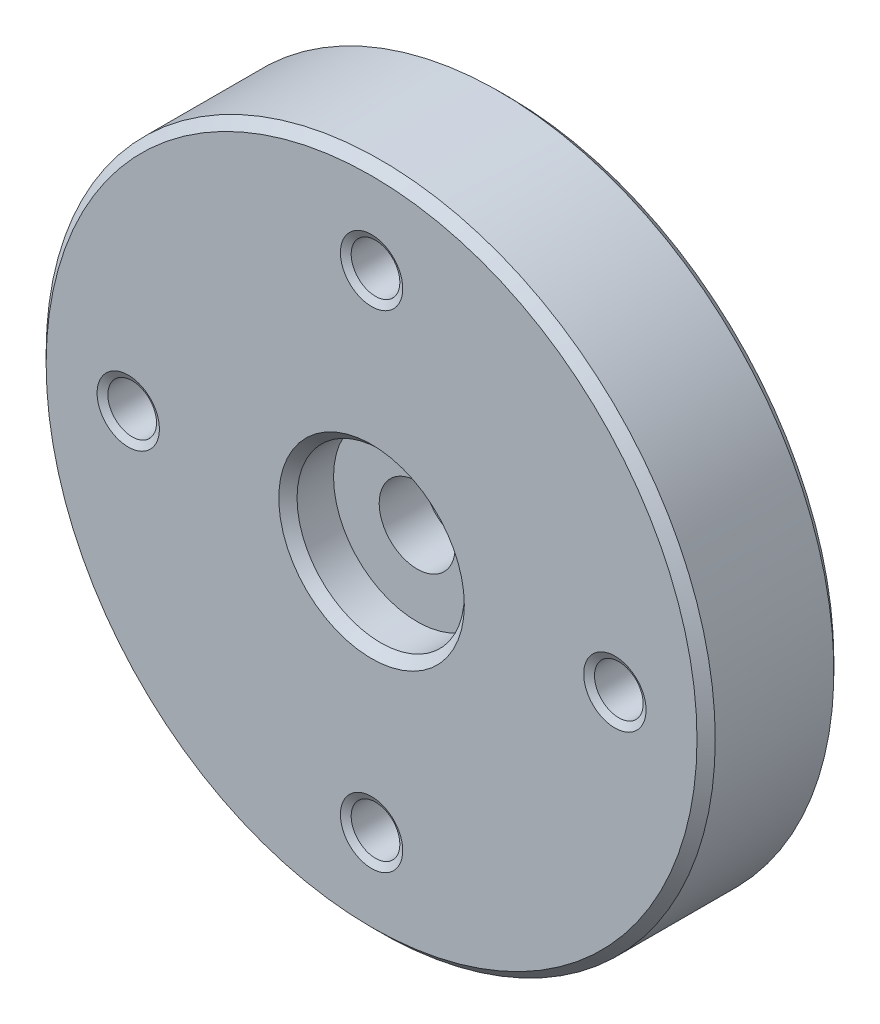
ISO-10303-21;
HEADER;
FILE_DESCRIPTION(('STEP AP214'),'2;1');
FILE_NAME('part.step','',(''),(''),'','','');
FILE_SCHEMA(('AUTOMOTIVE_DESIGN { 1 0 10303 214 1 1 1 1 }'));
ENDSEC;
DATA;
#1=APPLICATION_CONTEXT('core data for automotive mechanical design processes');
#2=APPLICATION_PROTOCOL_DEFINITION('international standard','automotive_design',2000,#1);
#3=PRODUCT_CONTEXT('',#1,'mechanical');
#4=PRODUCT('Part','Part','',(#3));
#5=PRODUCT_RELATED_PRODUCT_CATEGORY('part','',(#4));
#6=PRODUCT_DEFINITION_FORMATION('','',#4);
#7=PRODUCT_DEFINITION_CONTEXT('part definition',#1,'design');
#8=PRODUCT_DEFINITION('design','',#6,#7);
#9=PRODUCT_DEFINITION_SHAPE('','',#8);
#10=(LENGTH_UNIT() NAMED_UNIT(*) SI_UNIT(.MILLI.,.METRE.));
#11=(NAMED_UNIT(*) PLANE_ANGLE_UNIT() SI_UNIT($,.RADIAN.));
#12=(NAMED_UNIT(*) SI_UNIT($,.STERADIAN.) SOLID_ANGLE_UNIT());
#13=UNCERTAINTY_MEASURE_WITH_UNIT(LENGTH_MEASURE(1.E-05),#10,'distance_accuracy_value','');
#14=(GEOMETRIC_REPRESENTATION_CONTEXT(3) GLOBAL_UNCERTAINTY_ASSIGNED_CONTEXT((#13)) GLOBAL_UNIT_ASSIGNED_CONTEXT((#10,
#11,#12)) REPRESENTATION_CONTEXT('',''));
#15=CARTESIAN_POINT('',(0.,0.,0.));
#16=DIRECTION('',(0.,0.,1.));
#17=DIRECTION('',(1.,0.,0.));
#18=AXIS2_PLACEMENT_3D('',#15,#16,#17);
#19=CARTESIAN_POINT('',(0.,0.,0.));
#20=DIRECTION('',(0.,0.,-1.));
#21=DIRECTION('',(-1.,0.,0.));
#22=AXIS2_PLACEMENT_3D('',#19,#20,#21);
#23=CYLINDRICAL_SURFACE('',#22,2.75);
#24=CARTESIAN_POINT('',(0.,0.,-0.300000000000006));
#25=DIRECTION('',(0.,0.,1.));
#26=DIRECTION('',(1.,0.,0.));
#27=AXIS2_PLACEMENT_3D('',#24,#25,#26);
#28=CIRCLE('',#27,2.75);
#29=CARTESIAN_POINT('',(2.75,0.,-0.300000000000006));
#30=VERTEX_POINT('',#29);
#31=EDGE_CURVE('E55',#30,#30,#28,.T.);
#32=ORIENTED_EDGE('',*,*,#31,.T.);
#33=EDGE_LOOP('',(#32));
#34=FACE_BOUND('',#33,.T.);
#35=CARTESIAN_POINT('',(0.,0.,-1.5));
#36=DIRECTION('',(0.,0.,-1.));
#37=DIRECTION('',(-1.,0.,0.));
#38=AXIS2_PLACEMENT_3D('',#35,#36,#37);
#39=CIRCLE('',#38,2.75);
#40=CARTESIAN_POINT('',(-2.75,0.,-1.5));
#41=VERTEX_POINT('',#40);
#42=EDGE_CURVE('E79',#41,#41,#39,.T.);
#43=ORIENTED_EDGE('',*,*,#42,.T.);
#44=EDGE_LOOP('',(#43));
#45=FACE_BOUND('',#44,.T.);
#46=ADVANCED_FACE('F32',(#34,#45),#23,.F.);
#47=CARTESIAN_POINT('',(0.,2.75,0.));
#48=DIRECTION('',(0.,0.,1.));
#49=DIRECTION('',(1.,0.,0.));
#50=AXIS2_PLACEMENT_3D('',#47,#48,#49);
#51=PLANE('',#50);
#52=CARTESIAN_POINT('',(0.,0.,0.));
#53=DIRECTION('',(0.,0.,1.));
#54=DIRECTION('',(1.,0.,0.));
#55=AXIS2_PLACEMENT_3D('',#52,#53,#54);
#56=CIRCLE('',#55,3.05);
#57=CARTESIAN_POINT('',(3.05,0.,0.));
#58=VERTEX_POINT('',#57);
#59=EDGE_CURVE('E58',#58,#58,#56,.F.);
#60=ORIENTED_EDGE('',*,*,#59,.T.);
#61=EDGE_LOOP('',(#60));
#62=FACE_BOUND('',#61,.T.);
#63=CARTESIAN_POINT('',(0.,0.,0.));
#64=DIRECTION('',(0.,0.,1.));
#65=DIRECTION('',(1.,0.,0.));
#66=AXIS2_PLACEMENT_3D('',#63,#64,#65);
#67=CIRCLE('',#66,10.7);
#68=CARTESIAN_POINT('',(10.7,0.,0.));
#69=VERTEX_POINT('',#68);
#70=EDGE_CURVE('E61',#69,#69,#67,.T.);
#71=ORIENTED_EDGE('',*,*,#70,.T.);
#72=EDGE_LOOP('',(#71));
#73=FACE_BOUND('',#72,.T.);
#74=CARTESIAN_POINT('',(0.,8.,0.));
#75=DIRECTION('',(0.,0.,1.));
#76=DIRECTION('',(1.,0.,0.));
#77=AXIS2_PLACEMENT_3D('',#74,#75,#76);
#78=CIRCLE('',#77,1.025);
#79=CARTESIAN_POINT('',(1.025,8.,0.));
#80=VERTEX_POINT('',#79);
#81=EDGE_CURVE('E124',#80,#80,#78,.T.);
#82=ORIENTED_EDGE('',*,*,#81,.F.);
#83=EDGE_LOOP('',(#82));
#84=FACE_BOUND('',#83,.T.);
#85=CARTESIAN_POINT('',(8.,0.,0.));
#86=DIRECTION('',(0.,0.,1.));
#87=DIRECTION('',(1.,0.,0.));
#88=AXIS2_PLACEMENT_3D('',#85,#86,#87);
#89=CIRCLE('',#88,1.025);
#90=CARTESIAN_POINT('',(9.025,0.,0.));
#91=VERTEX_POINT('',#90);
#92=EDGE_CURVE('E112',#91,#91,#89,.T.);
#93=ORIENTED_EDGE('',*,*,#92,.F.);
#94=EDGE_LOOP('',(#93));
#95=FACE_BOUND('',#94,.T.);
#96=CARTESIAN_POINT('',(0.,-8.,0.));
#97=DIRECTION('',(0.,0.,1.));
#98=DIRECTION('',(1.,0.,0.));
#99=AXIS2_PLACEMENT_3D('',#96,#97,#98);
#100=CIRCLE('',#99,1.025);
#101=CARTESIAN_POINT('',(1.025,-8.,0.));
#102=VERTEX_POINT('',#101);
#103=EDGE_CURVE('E100',#102,#102,#100,.T.);
#104=ORIENTED_EDGE('',*,*,#103,.F.);
#105=EDGE_LOOP('',(#104));
#106=FACE_BOUND('',#105,.T.);
#107=CARTESIAN_POINT('',(-8.,0.,0.));
#108=DIRECTION('',(0.,0.,1.));
#109=DIRECTION('',(1.,0.,0.));
#110=AXIS2_PLACEMENT_3D('',#107,#108,#109);
#111=CIRCLE('',#110,1.025);
#112=CARTESIAN_POINT('',(-6.975,0.,0.));
#113=VERTEX_POINT('',#112);
#114=EDGE_CURVE('E88',#113,#113,#111,.T.);
#115=ORIENTED_EDGE('',*,*,#114,.F.);
#116=EDGE_LOOP('',(#115));
#117=FACE_BOUND('',#116,.T.);
#118=ADVANCED_FACE('F154',(#62,#73,#84,#95,#106,#117),#51,.T.);
#119=CARTESIAN_POINT('',(0.,0.,0.));
#120=DIRECTION('',(0.,0.,-1.));
#121=DIRECTION('',(-1.,0.,0.));
#122=AXIS2_PLACEMENT_3D('',#119,#120,#121);
#123=CYLINDRICAL_SURFACE('',#122,11.);
#124=CARTESIAN_POINT('',(0.,0.,-4.2));
#125=DIRECTION('',(0.,0.,-1.));
#126=DIRECTION('',(-1.,0.,0.));
#127=AXIS2_PLACEMENT_3D('',#124,#125,#126);
#128=CIRCLE('',#127,11.);
#129=CARTESIAN_POINT('',(-11.,0.,-4.2));
#130=VERTEX_POINT('',#129);
#131=EDGE_CURVE('E10',#130,#130,#128,.F.);
#132=ORIENTED_EDGE('',*,*,#131,.T.);
#133=EDGE_LOOP('',(#132));
#134=FACE_BOUND('',#133,.T.);
#135=CARTESIAN_POINT('',(0.,0.,-0.299999999999998));
#136=DIRECTION('',(0.,0.,1.));
#137=DIRECTION('',(1.,0.,0.));
#138=AXIS2_PLACEMENT_3D('',#135,#136,#137);
#139=CIRCLE('',#138,11.);
#140=CARTESIAN_POINT('',(11.,0.,-0.299999999999998));
#141=VERTEX_POINT('',#140);
#142=EDGE_CURVE('E39',#141,#141,#139,.F.);
#143=ORIENTED_EDGE('',*,*,#142,.T.);
#144=EDGE_LOOP('',(#143));
#145=FACE_BOUND('',#144,.T.);
#146=ADVANCED_FACE('F157',(#134,#145),#123,.T.);
#147=CARTESIAN_POINT('',(0.,11.,-4.5));
#148=DIRECTION('',(0.,0.,-1.));
#149=DIRECTION('',(-1.,0.,0.));
#150=AXIS2_PLACEMENT_3D('',#147,#148,#149);
#151=PLANE('',#150);
#152=CARTESIAN_POINT('',(0.,0.,-4.5));
#153=DIRECTION('',(0.,0.,-1.));
#154=DIRECTION('',(-1.,0.,0.));
#155=AXIS2_PLACEMENT_3D('',#152,#153,#154);
#156=CIRCLE('',#155,10.7);
#157=CARTESIAN_POINT('',(-10.7,0.,-4.5));
#158=VERTEX_POINT('',#157);
#159=EDGE_CURVE('E43',#158,#158,#156,.T.);
#160=ORIENTED_EDGE('',*,*,#159,.T.);
#161=EDGE_LOOP('',(#160));
#162=FACE_BOUND('',#161,.T.);
#163=CARTESIAN_POINT('',(0.,8.,-4.5));
#164=DIRECTION('',(0.,0.,1.));
#165=DIRECTION('',(1.,0.,0.));
#166=AXIS2_PLACEMENT_3D('',#163,#164,#165);
#167=CIRCLE('',#166,1.025);
#168=CARTESIAN_POINT('',(1.025,8.,-4.5));
#169=VERTEX_POINT('',#168);
#170=EDGE_CURVE('E127',#169,#169,#167,.T.);
#171=ORIENTED_EDGE('',*,*,#170,.T.);
#172=EDGE_LOOP('',(#171));
#173=FACE_BOUND('',#172,.T.);
#174=CARTESIAN_POINT('',(8.,0.,-4.5));
#175=DIRECTION('',(0.,0.,1.));
#176=DIRECTION('',(1.,0.,0.));
#177=AXIS2_PLACEMENT_3D('',#174,#175,#176);
#178=CIRCLE('',#177,1.025);
#179=CARTESIAN_POINT('',(9.025,0.,-4.5));
#180=VERTEX_POINT('',#179);
#181=EDGE_CURVE('E115',#180,#180,#178,.T.);
#182=ORIENTED_EDGE('',*,*,#181,.T.);
#183=EDGE_LOOP('',(#182));
#184=FACE_BOUND('',#183,.T.);
#185=CARTESIAN_POINT('',(0.,-8.,-4.5));
#186=DIRECTION('',(0.,0.,1.));
#187=DIRECTION('',(1.,0.,0.));
#188=AXIS2_PLACEMENT_3D('',#185,#186,#187);
#189=CIRCLE('',#188,1.025);
#190=CARTESIAN_POINT('',(1.025,-8.,-4.5));
#191=VERTEX_POINT('',#190);
#192=EDGE_CURVE('E103',#191,#191,#189,.T.);
#193=ORIENTED_EDGE('',*,*,#192,.T.);
#194=EDGE_LOOP('',(#193));
#195=FACE_BOUND('',#194,.T.);
#196=CARTESIAN_POINT('',(-8.,0.,-4.5));
#197=DIRECTION('',(0.,0.,1.));
#198=DIRECTION('',(1.,0.,0.));
#199=AXIS2_PLACEMENT_3D('',#196,#197,#198);
#200=CIRCLE('',#199,1.025);
#201=CARTESIAN_POINT('',(-6.975,0.,-4.5));
#202=VERTEX_POINT('',#201);
#203=EDGE_CURVE('E91',#202,#202,#200,.T.);
#204=ORIENTED_EDGE('',*,*,#203,.T.);
#205=EDGE_LOOP('',(#204));
#206=FACE_BOUND('',#205,.T.);
#207=CARTESIAN_POINT('',(0.,0.,-4.5));
#208=DIRECTION('',(0.,0.,-1.));
#209=DIRECTION('',(-1.,0.,0.));
#210=AXIS2_PLACEMENT_3D('',#207,#208,#209);
#211=CIRCLE('',#210,4.5);
#212=CARTESIAN_POINT('',(-4.5,0.,-4.5));
#213=VERTEX_POINT('',#212);
#214=EDGE_CURVE('E64',#213,#213,#211,.T.);
#215=ORIENTED_EDGE('',*,*,#214,.F.);
#216=EDGE_LOOP('',(#215));
#217=FACE_BOUND('',#216,.T.);
#218=ADVANCED_FACE('F131',(#162,#173,#184,#195,#206,#217),#151,.T.);
#219=CARTESIAN_POINT('',(0.,0.,0.));
#220=DIRECTION('',(0.,0.,-1.));
#221=DIRECTION('',(-1.,0.,0.));
#222=AXIS2_PLACEMENT_3D('',#219,#220,#221);
#223=CYLINDRICAL_SURFACE('',#222,4.5);
#224=CARTESIAN_POINT('',(0.,0.,-6.4));
#225=DIRECTION('',(0.,0.,-1.));
#226=DIRECTION('',(-1.,0.,0.));
#227=AXIS2_PLACEMENT_3D('',#224,#225,#226);
#228=CIRCLE('',#227,4.5);
#229=CARTESIAN_POINT('',(-4.5,0.,-6.4));
#230=VERTEX_POINT('',#229);
#231=EDGE_CURVE('E47',#230,#230,#228,.F.);
#232=ORIENTED_EDGE('',*,*,#231,.T.);
#233=EDGE_LOOP('',(#232));
#234=FACE_BOUND('',#233,.T.);
#235=ORIENTED_EDGE('',*,*,#214,.T.);
#236=EDGE_LOOP('',(#235));
#237=FACE_BOUND('',#236,.T.);
#238=ADVANCED_FACE('F208',(#234,#237),#223,.T.);
#239=CARTESIAN_POINT('',(0.,4.5,-6.7));
#240=DIRECTION('',(0.,0.,-1.));
#241=DIRECTION('',(-1.,0.,0.));
#242=AXIS2_PLACEMENT_3D('',#239,#240,#241);
#243=PLANE('',#242);
#244=CARTESIAN_POINT('',(0.,0.,-6.7));
#245=DIRECTION('',(0.,0.,-1.));
#246=DIRECTION('',(-1.,0.,0.));
#247=AXIS2_PLACEMENT_3D('',#244,#245,#246);
#248=CIRCLE('',#247,4.2);
#249=CARTESIAN_POINT('',(-4.2,0.,-6.7));
#250=VERTEX_POINT('',#249);
#251=EDGE_CURVE('E52',#250,#250,#248,.T.);
#252=ORIENTED_EDGE('',*,*,#251,.T.);
#253=EDGE_LOOP('',(#252));
#254=FACE_BOUND('',#253,.T.);
#255=CARTESIAN_POINT('',(0.,0.,-6.7));
#256=DIRECTION('',(0.,0.,-1.));
#257=DIRECTION('',(-1.,0.,0.));
#258=AXIS2_PLACEMENT_3D('',#255,#256,#257);
#259=CIRCLE('',#258,2.75);
#260=CARTESIAN_POINT('',(-2.75,0.,-6.7));
#261=VERTEX_POINT('',#260);
#262=EDGE_CURVE('E67',#261,#261,#259,.T.);
#263=ORIENTED_EDGE('',*,*,#262,.F.);
#264=EDGE_LOOP('',(#263));
#265=FACE_BOUND('',#264,.T.);
#266=ADVANCED_FACE('F214',(#254,#265),#243,.T.);
#267=CARTESIAN_POINT('',(0.,0.,0.));
#268=DIRECTION('',(0.,0.,-1.));
#269=DIRECTION('',(-1.,0.,0.));
#270=AXIS2_PLACEMENT_3D('',#267,#268,#269);
#271=CYLINDRICAL_SURFACE('',#270,2.75);
#272=ORIENTED_EDGE('',*,*,#262,.T.);
#273=EDGE_LOOP('',(#272));
#274=FACE_BOUND('',#273,.T.);
#275=CARTESIAN_POINT('',(0.,0.,-3.));
#276=DIRECTION('',(0.,0.,-1.));
#277=DIRECTION('',(-1.,0.,0.));
#278=AXIS2_PLACEMENT_3D('',#275,#276,#277);
#279=CIRCLE('',#278,2.75);
#280=CARTESIAN_POINT('',(-2.75,0.,-3.));
#281=VERTEX_POINT('',#280);
#282=EDGE_CURVE('E70',#281,#281,#279,.T.);
#283=ORIENTED_EDGE('',*,*,#282,.F.);
#284=EDGE_LOOP('',(#283));
#285=FACE_BOUND('',#284,.T.);
#286=ADVANCED_FACE('F220',(#274,#285),#271,.F.);
#287=CARTESIAN_POINT('',(0.,2.75,-3.));
#288=DIRECTION('',(0.,0.,-1.));
#289=DIRECTION('',(-1.,0.,0.));
#290=AXIS2_PLACEMENT_3D('',#287,#288,#289);
#291=PLANE('',#290);
#292=ORIENTED_EDGE('',*,*,#282,.T.);
#293=EDGE_LOOP('',(#292));
#294=FACE_BOUND('',#293,.T.);
#295=CARTESIAN_POINT('',(0.,0.,-3.));
#296=DIRECTION('',(0.,0.,-1.));
#297=DIRECTION('',(-1.,0.,0.));
#298=AXIS2_PLACEMENT_3D('',#295,#296,#297);
#299=CIRCLE('',#298,1.25);
#300=CARTESIAN_POINT('',(-1.25,0.,-3.));
#301=VERTEX_POINT('',#300);
#302=EDGE_CURVE('E73',#301,#301,#299,.T.);
#303=ORIENTED_EDGE('',*,*,#302,.F.);
#304=EDGE_LOOP('',(#303));
#305=FACE_BOUND('',#304,.T.);
#306=ADVANCED_FACE('F224',(#294,#305),#291,.T.);
#307=CARTESIAN_POINT('',(0.,0.,0.));
#308=DIRECTION('',(0.,0.,-1.));
#309=DIRECTION('',(-1.,0.,0.));
#310=AXIS2_PLACEMENT_3D('',#307,#308,#309);
#311=CYLINDRICAL_SURFACE('',#310,1.25);
#312=ORIENTED_EDGE('',*,*,#302,.T.);
#313=EDGE_LOOP('',(#312));
#314=FACE_BOUND('',#313,.T.);
#315=CARTESIAN_POINT('',(0.,0.,-1.5));
#316=DIRECTION('',(0.,0.,-1.));
#317=DIRECTION('',(-1.,0.,0.));
#318=AXIS2_PLACEMENT_3D('',#315,#316,#317);
#319=CIRCLE('',#318,1.25);
#320=CARTESIAN_POINT('',(-1.25,0.,-1.5));
#321=VERTEX_POINT('',#320);
#322=EDGE_CURVE('E76',#321,#321,#319,.T.);
#323=ORIENTED_EDGE('',*,*,#322,.F.);
#324=EDGE_LOOP('',(#323));
#325=FACE_BOUND('',#324,.T.);
#326=ADVANCED_FACE('F228',(#314,#325),#311,.F.);
#327=CARTESIAN_POINT('',(0.,2.75,-1.5));
#328=DIRECTION('',(0.,0.,1.));
#329=DIRECTION('',(1.,0.,0.));
#330=AXIS2_PLACEMENT_3D('',#327,#328,#329);
#331=PLANE('',#330);
#332=ORIENTED_EDGE('',*,*,#322,.T.);
#333=EDGE_LOOP('',(#332));
#334=FACE_BOUND('',#333,.T.);
#335=ORIENTED_EDGE('',*,*,#42,.F.);
#336=EDGE_LOOP('',(#335));
#337=FACE_BOUND('',#336,.T.);
#338=ADVANCED_FACE('F232',(#334,#337),#331,.T.);
#339=CARTESIAN_POINT('',(-8.,0.,-4.37009618943233));
#340=DIRECTION('',(0.,0.,-1.));
#341=DIRECTION('',(-1.,0.,0.));
#342=AXIS2_PLACEMENT_3D('',#339,#340,#341);
#343=CONICAL_SURFACE('',#342,0.799999999999999,1.0471975511966);
#344=ORIENTED_EDGE('',*,*,#203,.F.);
#345=EDGE_LOOP('',(#344));
#346=FACE_BOUND('',#345,.T.);
#347=CARTESIAN_POINT('',(-8.,0.,-4.37009618943233));
#348=DIRECTION('',(0.,0.,1.));
#349=DIRECTION('',(1.,0.,0.));
#350=AXIS2_PLACEMENT_3D('',#347,#348,#349);
#351=CIRCLE('',#350,0.799999999999999);
#352=CARTESIAN_POINT('',(-7.2,0.,-4.37009618943233));
#353=VERTEX_POINT('',#352);
#354=EDGE_CURVE('E82',#353,#353,#351,.T.);
#355=ORIENTED_EDGE('',*,*,#354,.T.);
#356=EDGE_LOOP('',(#355));
#357=FACE_BOUND('',#356,.T.);
#358=ADVANCED_FACE('F179',(#346,#357),#343,.F.);
#359=CARTESIAN_POINT('',(-8.,0.,0.));
#360=DIRECTION('',(0.,0.,1.));
#361=DIRECTION('',(1.,0.,0.));
#362=AXIS2_PLACEMENT_3D('',#359,#360,#361);
#363=CYLINDRICAL_SURFACE('',#362,0.799999999999999);
#364=ORIENTED_EDGE('',*,*,#354,.F.);
#365=EDGE_LOOP('',(#364));
#366=FACE_BOUND('',#365,.T.);
#367=CARTESIAN_POINT('',(-8.,0.,-0.129903810567662));
#368=DIRECTION('',(0.,0.,1.));
#369=DIRECTION('',(1.,0.,0.));
#370=AXIS2_PLACEMENT_3D('',#367,#368,#369);
#371=CIRCLE('',#370,0.8);
#372=CARTESIAN_POINT('',(-7.2,0.,-0.129903810567662));
#373=VERTEX_POINT('',#372);
#374=EDGE_CURVE('E85',#373,#373,#371,.T.);
#375=ORIENTED_EDGE('',*,*,#374,.T.);
#376=EDGE_LOOP('',(#375));
#377=FACE_BOUND('',#376,.T.);
#378=ADVANCED_FACE('F169',(#366,#377),#363,.F.);
#379=CARTESIAN_POINT('',(-8.,0.,0.));
#380=DIRECTION('',(0.,0.,1.));
#381=DIRECTION('',(1.,0.,0.));
#382=AXIS2_PLACEMENT_3D('',#379,#380,#381);
#383=CONICAL_SURFACE('',#382,1.025,1.0471975511966);
#384=ORIENTED_EDGE('',*,*,#374,.F.);
#385=EDGE_LOOP('',(#384));
#386=FACE_BOUND('',#385,.T.);
#387=ORIENTED_EDGE('',*,*,#114,.T.);
#388=EDGE_LOOP('',(#387));
#389=FACE_BOUND('',#388,.T.);
#390=ADVANCED_FACE('F166',(#386,#389),#383,.F.);
#391=CARTESIAN_POINT('',(0.,-8.,-4.37009618943233));
#392=DIRECTION('',(0.,0.,-1.));
#393=DIRECTION('',(-1.,0.,0.));
#394=AXIS2_PLACEMENT_3D('',#391,#392,#393);
#395=CONICAL_SURFACE('',#394,0.799999999999999,1.0471975511966);
#396=ORIENTED_EDGE('',*,*,#192,.F.);
#397=EDGE_LOOP('',(#396));
#398=FACE_BOUND('',#397,.T.);
#399=CARTESIAN_POINT('',(0.,-8.,-4.37009618943233));
#400=DIRECTION('',(0.,0.,1.));
#401=DIRECTION('',(1.,0.,0.));
#402=AXIS2_PLACEMENT_3D('',#399,#400,#401);
#403=CIRCLE('',#402,0.799999999999999);
#404=CARTESIAN_POINT('',(0.799999999999999,-8.,-4.37009618943233));
#405=VERTEX_POINT('',#404);
#406=EDGE_CURVE('E94',#405,#405,#403,.T.);
#407=ORIENTED_EDGE('',*,*,#406,.T.);
#408=EDGE_LOOP('',(#407));
#409=FACE_BOUND('',#408,.T.);
#410=ADVANCED_FACE('F168',(#398,#409),#395,.F.);
#411=CARTESIAN_POINT('',(0.,-8.,0.));
#412=DIRECTION('',(0.,0.,1.));
#413=DIRECTION('',(1.,0.,0.));
#414=AXIS2_PLACEMENT_3D('',#411,#412,#413);
#415=CYLINDRICAL_SURFACE('',#414,0.799999999999999);
#416=ORIENTED_EDGE('',*,*,#406,.F.);
#417=EDGE_LOOP('',(#416));
#418=FACE_BOUND('',#417,.T.);
#419=CARTESIAN_POINT('',(0.,-8.,-0.129903810567662));
#420=DIRECTION('',(0.,0.,1.));
#421=DIRECTION('',(1.,0.,0.));
#422=AXIS2_PLACEMENT_3D('',#419,#420,#421);
#423=CIRCLE('',#422,0.8);
#424=CARTESIAN_POINT('',(0.8,-8.,-0.129903810567662));
#425=VERTEX_POINT('',#424);
#426=EDGE_CURVE('E97',#425,#425,#423,.T.);
#427=ORIENTED_EDGE('',*,*,#426,.T.);
#428=EDGE_LOOP('',(#427));
#429=FACE_BOUND('',#428,.T.);
#430=ADVANCED_FACE('F176',(#418,#429),#415,.F.);
#431=CARTESIAN_POINT('',(0.,-8.,0.));
#432=DIRECTION('',(0.,0.,1.));
#433=DIRECTION('',(1.,0.,0.));
#434=AXIS2_PLACEMENT_3D('',#431,#432,#433);
#435=CONICAL_SURFACE('',#434,1.025,1.0471975511966);
#436=ORIENTED_EDGE('',*,*,#426,.F.);
#437=EDGE_LOOP('',(#436));
#438=FACE_BOUND('',#437,.T.);
#439=ORIENTED_EDGE('',*,*,#103,.T.);
#440=EDGE_LOOP('',(#439));
#441=FACE_BOUND('',#440,.T.);
#442=ADVANCED_FACE('F331',(#438,#441),#435,.F.);
#443=CARTESIAN_POINT('',(8.,0.,-4.37009618943233));
#444=DIRECTION('',(0.,0.,-1.));
#445=DIRECTION('',(-1.,0.,0.));
#446=AXIS2_PLACEMENT_3D('',#443,#444,#445);
#447=CONICAL_SURFACE('',#446,0.799999999999999,1.04719755119659);
#448=ORIENTED_EDGE('',*,*,#181,.F.);
#449=EDGE_LOOP('',(#448));
#450=FACE_BOUND('',#449,.T.);
#451=CARTESIAN_POINT('',(8.,0.,-4.37009618943233));
#452=DIRECTION('',(0.,0.,1.));
#453=DIRECTION('',(1.,0.,0.));
#454=AXIS2_PLACEMENT_3D('',#451,#452,#453);
#455=CIRCLE('',#454,0.799999999999999);
#456=CARTESIAN_POINT('',(8.8,0.,-4.37009618943233));
#457=VERTEX_POINT('',#456);
#458=EDGE_CURVE('E106',#457,#457,#455,.T.);
#459=ORIENTED_EDGE('',*,*,#458,.T.);
#460=EDGE_LOOP('',(#459));
#461=FACE_BOUND('',#460,.T.);
#462=ADVANCED_FACE('F322',(#450,#461),#447,.F.);
#463=CARTESIAN_POINT('',(8.,0.,0.));
#464=DIRECTION('',(0.,0.,1.));
#465=DIRECTION('',(1.,0.,0.));
#466=AXIS2_PLACEMENT_3D('',#463,#464,#465);
#467=CYLINDRICAL_SURFACE('',#466,0.799999999999999);
#468=ORIENTED_EDGE('',*,*,#458,.F.);
#469=EDGE_LOOP('',(#468));
#470=FACE_BOUND('',#469,.T.);
#471=CARTESIAN_POINT('',(8.,0.,-0.129903810567662));
#472=DIRECTION('',(0.,0.,1.));
#473=DIRECTION('',(1.,0.,0.));
#474=AXIS2_PLACEMENT_3D('',#471,#472,#473);
#475=CIRCLE('',#474,0.8);
#476=CARTESIAN_POINT('',(8.8,0.,-0.129903810567662));
#477=VERTEX_POINT('',#476);
#478=EDGE_CURVE('E109',#477,#477,#475,.T.);
#479=ORIENTED_EDGE('',*,*,#478,.T.);
#480=EDGE_LOOP('',(#479));
#481=FACE_BOUND('',#480,.T.);
#482=ADVANCED_FACE('F313',(#470,#481),#467,.F.);
#483=CARTESIAN_POINT('',(8.,0.,0.));
#484=DIRECTION('',(0.,0.,1.));
#485=DIRECTION('',(1.,0.,0.));
#486=AXIS2_PLACEMENT_3D('',#483,#484,#485);
#487=CONICAL_SURFACE('',#486,1.025,1.0471975511966);
#488=ORIENTED_EDGE('',*,*,#478,.F.);
#489=EDGE_LOOP('',(#488));
#490=FACE_BOUND('',#489,.T.);
#491=ORIENTED_EDGE('',*,*,#92,.T.);
#492=EDGE_LOOP('',(#491));
#493=FACE_BOUND('',#492,.T.);
#494=ADVANCED_FACE('F138',(#490,#493),#487,.F.);
#495=CARTESIAN_POINT('',(0.,8.,-4.37009618943233));
#496=DIRECTION('',(0.,0.,-1.));
#497=DIRECTION('',(-1.,0.,0.));
#498=AXIS2_PLACEMENT_3D('',#495,#496,#497);
#499=CONICAL_SURFACE('',#498,0.799999999999999,1.0471975511966);
#500=ORIENTED_EDGE('',*,*,#170,.F.);
#501=EDGE_LOOP('',(#500));
#502=FACE_BOUND('',#501,.T.);
#503=CARTESIAN_POINT('',(0.,8.,-4.37009618943233));
#504=DIRECTION('',(0.,0.,1.));
#505=DIRECTION('',(1.,0.,0.));
#506=AXIS2_PLACEMENT_3D('',#503,#504,#505);
#507=CIRCLE('',#506,0.799999999999999);
#508=CARTESIAN_POINT('',(0.799999999999999,8.,-4.37009618943233));
#509=VERTEX_POINT('',#508);
#510=EDGE_CURVE('E118',#509,#509,#507,.T.);
#511=ORIENTED_EDGE('',*,*,#510,.T.);
#512=EDGE_LOOP('',(#511));
#513=FACE_BOUND('',#512,.T.);
#514=ADVANCED_FACE('F134',(#502,#513),#499,.F.);
#515=CARTESIAN_POINT('',(0.,8.,0.));
#516=DIRECTION('',(0.,0.,1.));
#517=DIRECTION('',(1.,0.,0.));
#518=AXIS2_PLACEMENT_3D('',#515,#516,#517);
#519=CYLINDRICAL_SURFACE('',#518,0.799999999999999);
#520=ORIENTED_EDGE('',*,*,#510,.F.);
#521=EDGE_LOOP('',(#520));
#522=FACE_BOUND('',#521,.T.);
#523=CARTESIAN_POINT('',(0.,8.,-0.129903810567662));
#524=DIRECTION('',(0.,0.,1.));
#525=DIRECTION('',(1.,0.,0.));
#526=AXIS2_PLACEMENT_3D('',#523,#524,#525);
#527=CIRCLE('',#526,0.8);
#528=CARTESIAN_POINT('',(0.8,8.,-0.129903810567662));
#529=VERTEX_POINT('',#528);
#530=EDGE_CURVE('E121',#529,#529,#527,.T.);
#531=ORIENTED_EDGE('',*,*,#530,.T.);
#532=EDGE_LOOP('',(#531));
#533=FACE_BOUND('',#532,.T.);
#534=ADVANCED_FACE('F137',(#522,#533),#519,.F.);
#535=CARTESIAN_POINT('',(0.,8.,0.));
#536=DIRECTION('',(0.,0.,1.));
#537=DIRECTION('',(1.,0.,0.));
#538=AXIS2_PLACEMENT_3D('',#535,#536,#537);
#539=CONICAL_SURFACE('',#538,1.025,1.0471975511966);
#540=ORIENTED_EDGE('',*,*,#530,.F.);
#541=EDGE_LOOP('',(#540));
#542=FACE_BOUND('',#541,.T.);
#543=ORIENTED_EDGE('',*,*,#81,.T.);
#544=EDGE_LOOP('',(#543));
#545=FACE_BOUND('',#544,.T.);
#546=ADVANCED_FACE('F144',(#542,#545),#539,.F.);
#547=CARTESIAN_POINT('',(0.,0.,0.));
#548=DIRECTION('',(0.,0.,1.));
#549=DIRECTION('',(1.,0.,0.));
#550=AXIS2_PLACEMENT_3D('',#547,#548,#549);
#551=CONICAL_SURFACE('',#550,3.05,0.78539816339744);
#552=ORIENTED_EDGE('',*,*,#31,.F.);
#553=EDGE_LOOP('',(#552));
#554=FACE_BOUND('',#553,.T.);
#555=ORIENTED_EDGE('',*,*,#59,.F.);
#556=EDGE_LOOP('',(#555));
#557=FACE_BOUND('',#556,.T.);
#558=ADVANCED_FACE('F150',(#554,#557),#551,.F.);
#559=CARTESIAN_POINT('',(0.,0.,-6.7));
#560=DIRECTION('',(0.,0.,1.));
#561=DIRECTION('',(1.,0.,0.));
#562=AXIS2_PLACEMENT_3D('',#559,#560,#561);
#563=CONICAL_SURFACE('',#562,4.2,0.785398163397445);
#564=ORIENTED_EDGE('',*,*,#231,.F.);
#565=EDGE_LOOP('',(#564));
#566=FACE_BOUND('',#565,.T.);
#567=ORIENTED_EDGE('',*,*,#251,.F.);
#568=EDGE_LOOP('',(#567));
#569=FACE_BOUND('',#568,.T.);
#570=ADVANCED_FACE('F193',(#566,#569),#563,.T.);
#571=CARTESIAN_POINT('',(0.,0.,-4.5));
#572=DIRECTION('',(0.,0.,1.));
#573=DIRECTION('',(1.,0.,0.));
#574=AXIS2_PLACEMENT_3D('',#571,#572,#573);
#575=CONICAL_SURFACE('',#574,10.7,0.785398163397451);
#576=ORIENTED_EDGE('',*,*,#131,.F.);
#577=EDGE_LOOP('',(#576));
#578=FACE_BOUND('',#577,.T.);
#579=ORIENTED_EDGE('',*,*,#159,.F.);
#580=EDGE_LOOP('',(#579));
#581=FACE_BOUND('',#580,.T.);
#582=ADVANCED_FACE('F196',(#578,#581),#575,.T.);
#583=CARTESIAN_POINT('',(0.,0.,-0.299999999999998));
#584=DIRECTION('',(0.,0.,-1.));
#585=DIRECTION('',(-1.,0.,0.));
#586=AXIS2_PLACEMENT_3D('',#583,#584,#585);
#587=CONICAL_SURFACE('',#586,11.,0.785398163397451);
#588=ORIENTED_EDGE('',*,*,#70,.F.);
#589=EDGE_LOOP('',(#588));
#590=FACE_BOUND('',#589,.T.);
#591=ORIENTED_EDGE('',*,*,#142,.F.);
#592=EDGE_LOOP('',(#591));
#593=FACE_BOUND('',#592,.T.);
#594=ADVANCED_FACE('F34',(#590,#593),#587,.T.);
#595=CLOSED_SHELL('',(#46,#118,#146,#218,#238,#266,#286,#306,#326,#338,#358,#378,#390,#410,#430,
#442,#462,#482,#494,#514,#534,#546,#558,#570,#582,#594));
#596=MANIFOLD_SOLID_BREP('B2',#595);
#597=ADVANCED_BREP_SHAPE_REPRESENTATION('',(#18,#596),#14);
#598=SHAPE_DEFINITION_REPRESENTATION(#9,#597);
ENDSEC;
END-ISO-10303-21;
